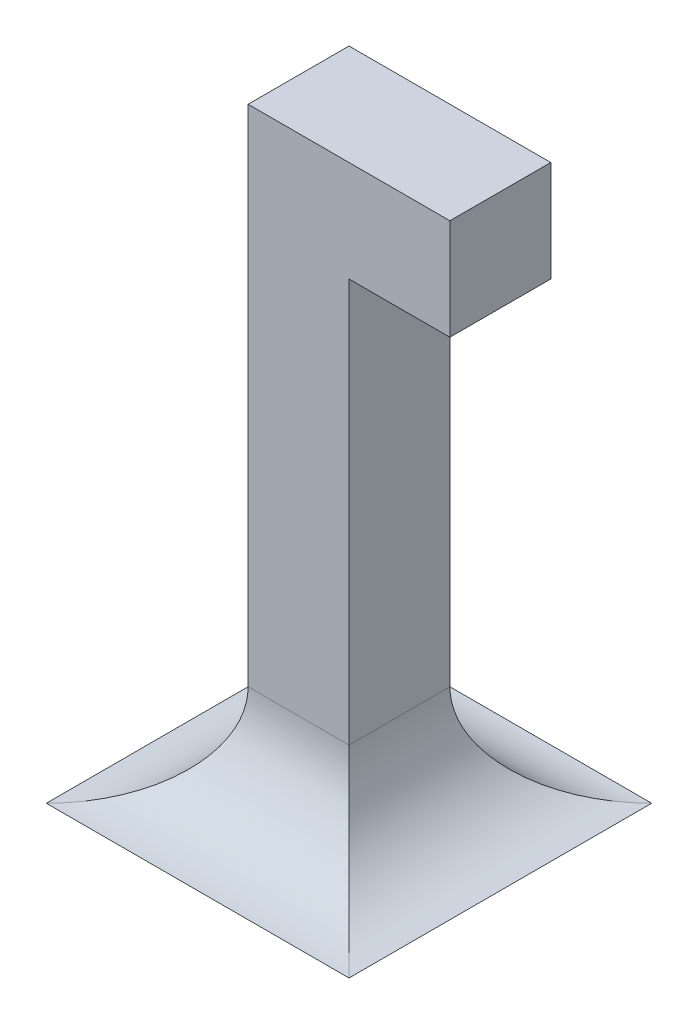
ISO-10303-21;
HEADER;
FILE_DESCRIPTION(('STEP AP214'),'2;1');
FILE_NAME('part.step','',(''),(''),'','','');
FILE_SCHEMA(('AUTOMOTIVE_DESIGN { 1 0 10303 214 1 1 1 1 }'));
ENDSEC;
DATA;
#1=APPLICATION_CONTEXT('core data for automotive mechanical design processes');
#2=APPLICATION_PROTOCOL_DEFINITION('international standard','automotive_design',2000,#1);
#3=PRODUCT_CONTEXT('',#1,'mechanical');
#4=PRODUCT('Part','Part','',(#3));
#5=PRODUCT_RELATED_PRODUCT_CATEGORY('part','',(#4));
#6=PRODUCT_DEFINITION_FORMATION('','',#4);
#7=PRODUCT_DEFINITION_CONTEXT('part definition',#1,'design');
#8=PRODUCT_DEFINITION('design','',#6,#7);
#9=PRODUCT_DEFINITION_SHAPE('','',#8);
#10=(LENGTH_UNIT() NAMED_UNIT(*) SI_UNIT(.MILLI.,.METRE.));
#11=(NAMED_UNIT(*) PLANE_ANGLE_UNIT() SI_UNIT($,.RADIAN.));
#12=(NAMED_UNIT(*) SI_UNIT($,.STERADIAN.) SOLID_ANGLE_UNIT());
#13=UNCERTAINTY_MEASURE_WITH_UNIT(LENGTH_MEASURE(1.E-05),#10,'distance_accuracy_value','');
#14=(GEOMETRIC_REPRESENTATION_CONTEXT(3) GLOBAL_UNCERTAINTY_ASSIGNED_CONTEXT((#13)) GLOBAL_UNIT_ASSIGNED_CONTEXT((#10,
#11,#12)) REPRESENTATION_CONTEXT('',''));
#15=CARTESIAN_POINT('',(0.,0.,0.));
#16=DIRECTION('',(0.,0.,1.));
#17=DIRECTION('',(1.,0.,0.));
#18=AXIS2_PLACEMENT_3D('',#15,#16,#17);
#19=CARTESIAN_POINT('',(83.9958786609766,35.,-15.));
#20=DIRECTION('',(0.,1.,0.));
#21=DIRECTION('',(0.,0.,1.));
#22=AXIS2_PLACEMENT_3D('',#19,#20,#21);
#23=PLANE('',#22);
#24=DIRECTION('',(0.,0.,-1.));
#25=VECTOR('',#24,1.);
#26=CARTESIAN_POINT('',(78.9958786609766,35.,-15.));
#27=LINE('',#26,#25);
#28=CARTESIAN_POINT('',(78.9958786609766,35.,-15.));
#29=VERTEX_POINT('',#28);
#30=CARTESIAN_POINT('',(78.9958786609766,35.,-20.));
#31=VERTEX_POINT('',#30);
#32=EDGE_CURVE('E147',#29,#31,#27,.T.);
#33=ORIENTED_EDGE('',*,*,#32,.T.);
#34=DIRECTION('',(-1.,0.,0.));
#35=VECTOR('',#34,1.);
#36=CARTESIAN_POINT('',(83.9958786609766,35.,-20.));
#37=LINE('',#36,#35);
#38=CARTESIAN_POINT('',(83.9958786609766,35.,-20.));
#39=VERTEX_POINT('',#38);
#40=EDGE_CURVE('E161',#39,#31,#37,.T.);
#41=ORIENTED_EDGE('',*,*,#40,.F.);
#42=DIRECTION('',(0.,0.,-1.));
#43=VECTOR('',#42,1.);
#44=CARTESIAN_POINT('',(83.9958786609766,35.,-15.));
#45=LINE('',#44,#43);
#46=CARTESIAN_POINT('',(83.9958786609766,35.,-15.));
#47=VERTEX_POINT('',#46);
#48=EDGE_CURVE('E155',#47,#39,#45,.T.);
#49=ORIENTED_EDGE('',*,*,#48,.F.);
#50=DIRECTION('',(-1.,0.,0.));
#51=VECTOR('',#50,1.);
#52=CARTESIAN_POINT('',(83.9958786609766,35.,-15.));
#53=LINE('',#52,#51);
#54=EDGE_CURVE('E163',#47,#29,#53,.T.);
#55=ORIENTED_EDGE('',*,*,#54,.T.);
#56=EDGE_LOOP('',(#33,#41,#49,#55));
#57=FACE_BOUND('',#56,.T.);
#58=ADVANCED_FACE('F43',(#57),#23,.F.);
#59=CARTESIAN_POINT('',(83.9958786609766,0.,0.));
#60=DIRECTION('',(1.,0.,0.));
#61=DIRECTION('',(0.,0.,-1.));
#62=AXIS2_PLACEMENT_3D('',#59,#60,#61);
#63=PLANE('',#62);
#64=DIRECTION('',(0.,-1.,0.));
#65=VECTOR('',#64,1.);
#66=CARTESIAN_POINT('',(83.9958786609766,40.,-15.));
#67=LINE('',#66,#65);
#68=CARTESIAN_POINT('',(83.9958786609766,40.,-15.));
#69=VERTEX_POINT('',#68);
#70=EDGE_CURVE('E148',#69,#47,#67,.T.);
#71=ORIENTED_EDGE('',*,*,#70,.T.);
#72=ORIENTED_EDGE('',*,*,#48,.T.);
#73=DIRECTION('',(0.,1.,0.));
#74=VECTOR('',#73,1.);
#75=CARTESIAN_POINT('',(83.9958786609766,40.,-20.));
#76=LINE('',#75,#74);
#77=CARTESIAN_POINT('',(83.9958786609766,40.,-20.));
#78=VERTEX_POINT('',#77);
#79=EDGE_CURVE('E323',#39,#78,#76,.T.);
#80=ORIENTED_EDGE('',*,*,#79,.T.);
#81=DIRECTION('',(0.,0.,1.));
#82=VECTOR('',#81,1.);
#83=CARTESIAN_POINT('',(83.9958786609766,40.,-15.));
#84=LINE('',#83,#82);
#85=EDGE_CURVE('E159',#78,#69,#84,.T.);
#86=ORIENTED_EDGE('',*,*,#85,.T.);
#87=EDGE_LOOP('',(#71,#72,#80,#86));
#88=FACE_BOUND('',#87,.T.);
#89=ADVANCED_FACE('F196',(#88),#63,.T.);
#90=CARTESIAN_POINT('',(0.,40.,0.));
#91=DIRECTION('',(0.,1.,0.));
#92=DIRECTION('',(0.,0.,1.));
#93=AXIS2_PLACEMENT_3D('',#90,#91,#92);
#94=PLANE('',#93);
#95=DIRECTION('',(1.,0.,0.));
#96=VECTOR('',#95,1.);
#97=CARTESIAN_POINT('',(73.9958786609766,40.,-15.));
#98=LINE('',#97,#96);
#99=CARTESIAN_POINT('',(73.9958786609766,40.,-15.));
#100=VERTEX_POINT('',#99);
#101=EDGE_CURVE('E169',#100,#69,#98,.T.);
#102=ORIENTED_EDGE('',*,*,#101,.T.);
#103=ORIENTED_EDGE('',*,*,#85,.F.);
#104=DIRECTION('',(-1.,0.,0.));
#105=VECTOR('',#104,1.);
#106=CARTESIAN_POINT('',(73.9958786609766,40.,-20.));
#107=LINE('',#106,#105);
#108=CARTESIAN_POINT('',(73.9958786609766,40.,-20.));
#109=VERTEX_POINT('',#108);
#110=EDGE_CURVE('E165',#78,#109,#107,.T.);
#111=ORIENTED_EDGE('',*,*,#110,.T.);
#112=DIRECTION('',(0.,0.,1.));
#113=VECTOR('',#112,1.);
#114=CARTESIAN_POINT('',(73.9958786609766,40.,-20.));
#115=LINE('',#114,#113);
#116=EDGE_CURVE('E167',#109,#100,#115,.T.);
#117=ORIENTED_EDGE('',*,*,#116,.T.);
#118=EDGE_LOOP('',(#102,#103,#111,#117));
#119=FACE_BOUND('',#118,.T.);
#120=ADVANCED_FACE('F201',(#119),#94,.T.);
#121=CARTESIAN_POINT('',(73.9958786609766,40.,-15.));
#122=DIRECTION('',(0.,0.,-1.));
#123=DIRECTION('',(-1.,0.,0.));
#124=AXIS2_PLACEMENT_3D('',#121,#122,#123);
#125=PLANE('',#124);
#126=DIRECTION('',(0.,-1.,0.));
#127=VECTOR('',#126,1.);
#128=CARTESIAN_POINT('',(73.9958786609766,40.,-15.));
#129=LINE('',#128,#127);
#130=CARTESIAN_POINT('',(73.9958786609766,15.,-15.));
#131=VERTEX_POINT('',#130);
#132=EDGE_CURVE('E173',#100,#131,#129,.T.);
#133=ORIENTED_EDGE('',*,*,#132,.T.);
#134=DIRECTION('',(1.,0.,0.));
#135=VECTOR('',#134,1.);
#136=CARTESIAN_POINT('',(73.9958786609766,15.,-15.));
#137=LINE('',#136,#135);
#138=CARTESIAN_POINT('',(78.9958786609766,15.,-15.));
#139=VERTEX_POINT('',#138);
#140=EDGE_CURVE('E66',#131,#139,#137,.T.);
#141=ORIENTED_EDGE('',*,*,#140,.T.);
#142=DIRECTION('',(0.,-1.,0.));
#143=VECTOR('',#142,1.);
#144=CARTESIAN_POINT('',(78.9958786609766,40.,-15.));
#145=LINE('',#144,#143);
#146=EDGE_CURVE('E171',#29,#139,#145,.T.);
#147=ORIENTED_EDGE('',*,*,#146,.F.);
#148=ORIENTED_EDGE('',*,*,#54,.F.);
#149=ORIENTED_EDGE('',*,*,#70,.F.);
#150=ORIENTED_EDGE('',*,*,#101,.F.);
#151=EDGE_LOOP('',(#133,#141,#147,#148,#149,#150));
#152=FACE_BOUND('',#151,.T.);
#153=ADVANCED_FACE('F208',(#152),#125,.F.);
#154=CARTESIAN_POINT('',(78.9958786609766,40.,-20.));
#155=DIRECTION('',(-1.,0.,0.));
#156=DIRECTION('',(0.,0.,1.));
#157=AXIS2_PLACEMENT_3D('',#154,#155,#156);
#158=PLANE('',#157);
#159=ORIENTED_EDGE('',*,*,#146,.T.);
#160=DIRECTION('',(0.,0.,-1.));
#161=VECTOR('',#160,1.);
#162=CARTESIAN_POINT('',(78.9958786609766,15.,-20.));
#163=LINE('',#162,#161);
#164=CARTESIAN_POINT('',(78.9958786609766,15.,-20.));
#165=VERTEX_POINT('',#164);
#166=EDGE_CURVE('E11',#139,#165,#163,.T.);
#167=ORIENTED_EDGE('',*,*,#166,.T.);
#168=DIRECTION('',(0.,-1.,0.));
#169=VECTOR('',#168,1.);
#170=CARTESIAN_POINT('',(78.9958786609766,40.,-20.));
#171=LINE('',#170,#169);
#172=EDGE_CURVE('E121',#31,#165,#171,.T.);
#173=ORIENTED_EDGE('',*,*,#172,.F.);
#174=ORIENTED_EDGE('',*,*,#32,.F.);
#175=EDGE_LOOP('',(#159,#167,#173,#174));
#176=FACE_BOUND('',#175,.T.);
#177=ADVANCED_FACE('F184',(#176),#158,.F.);
#178=CARTESIAN_POINT('',(73.9958786609766,40.,-20.));
#179=DIRECTION('',(1.,0.,0.));
#180=DIRECTION('',(0.,0.,-1.));
#181=AXIS2_PLACEMENT_3D('',#178,#179,#180);
#182=PLANE('',#181);
#183=DIRECTION('',(0.,-1.,0.));
#184=VECTOR('',#183,1.);
#185=CARTESIAN_POINT('',(73.9958786609766,40.,-20.));
#186=LINE('',#185,#184);
#187=CARTESIAN_POINT('',(73.9958786609766,15.,-20.));
#188=VERTEX_POINT('',#187);
#189=EDGE_CURVE('E175',#109,#188,#186,.T.);
#190=ORIENTED_EDGE('',*,*,#189,.T.);
#191=DIRECTION('',(0.,0.,1.));
#192=VECTOR('',#191,1.);
#193=CARTESIAN_POINT('',(73.9958786609766,15.,-20.));
#194=LINE('',#193,#192);
#195=EDGE_CURVE('E52',#188,#131,#194,.T.);
#196=ORIENTED_EDGE('',*,*,#195,.T.);
#197=ORIENTED_EDGE('',*,*,#132,.F.);
#198=ORIENTED_EDGE('',*,*,#116,.F.);
#199=EDGE_LOOP('',(#190,#196,#197,#198));
#200=FACE_BOUND('',#199,.T.);
#201=ADVANCED_FACE('F212',(#200),#182,.F.);
#202=CARTESIAN_POINT('',(73.9958786609766,40.,-20.));
#203=DIRECTION('',(0.,0.,1.));
#204=DIRECTION('',(1.,0.,0.));
#205=AXIS2_PLACEMENT_3D('',#202,#203,#204);
#206=PLANE('',#205);
#207=ORIENTED_EDGE('',*,*,#172,.T.);
#208=DIRECTION('',(-1.,0.,0.));
#209=VECTOR('',#208,1.);
#210=CARTESIAN_POINT('',(73.9958786609766,15.,-20.));
#211=LINE('',#210,#209);
#212=EDGE_CURVE('E120',#165,#188,#211,.T.);
#213=ORIENTED_EDGE('',*,*,#212,.T.);
#214=ORIENTED_EDGE('',*,*,#189,.F.);
#215=ORIENTED_EDGE('',*,*,#110,.F.);
#216=ORIENTED_EDGE('',*,*,#79,.F.);
#217=ORIENTED_EDGE('',*,*,#40,.T.);
#218=EDGE_LOOP('',(#207,#213,#214,#215,#216,#217));
#219=FACE_BOUND('',#218,.T.);
#220=ADVANCED_FACE('F180',(#219),#206,.F.);
#221=CARTESIAN_POINT('',(73.9958786609766,15.,-25.));
#222=DIRECTION('',(-1.,0.,0.));
#223=DIRECTION('',(0.,0.,1.));
#224=AXIS2_PLACEMENT_3D('',#221,#222,#223);
#225=CYLINDRICAL_SURFACE('',#224,5.);
#226=CARTESIAN_POINT('',(83.9958786609766,15.,-25.));
#227=DIRECTION('',(-0.707106781186547,0.,-0.707106781186547));
#228=DIRECTION('',(0.707106781186547,0.,-0.707106781186547));
#229=AXIS2_PLACEMENT_3D('',#226,#227,#228);
#230=ELLIPSE('',#229,7.07106781186547,5.);
#231=CARTESIAN_POINT('',(83.9958786609766,10.,-25.));
#232=VERTEX_POINT('',#231);
#233=EDGE_CURVE('E125',#165,#232,#230,.F.);
#234=ORIENTED_EDGE('',*,*,#233,.T.);
#235=DIRECTION('',(-1.,0.,0.));
#236=VECTOR('',#235,1.);
#237=CARTESIAN_POINT('',(17.5,10.,-25.));
#238=LINE('',#237,#236);
#239=CARTESIAN_POINT('',(68.9958786609766,10.,-25.));
#240=VERTEX_POINT('',#239);
#241=EDGE_CURVE('E110',#232,#240,#238,.T.);
#242=ORIENTED_EDGE('',*,*,#241,.T.);
#243=CARTESIAN_POINT('',(68.9958786609766,15.,-25.));
#244=DIRECTION('',(-0.707106781186547,0.,0.707106781186547));
#245=DIRECTION('',(0.707106781186547,0.,0.707106781186547));
#246=AXIS2_PLACEMENT_3D('',#243,#244,#245);
#247=ELLIPSE('',#246,7.07106781186547,5.);
#248=EDGE_CURVE('E131',#240,#188,#247,.T.);
#249=ORIENTED_EDGE('',*,*,#248,.T.);
#250=ORIENTED_EDGE('',*,*,#212,.F.);
#251=EDGE_LOOP('',(#234,#242,#249,#250));
#252=FACE_BOUND('',#251,.T.);
#253=ADVANCED_FACE('F126',(#252),#225,.F.);
#254=CARTESIAN_POINT('',(68.9958786609766,15.,-20.));
#255=DIRECTION('',(0.,0.,1.));
#256=DIRECTION('',(1.,0.,0.));
#257=AXIS2_PLACEMENT_3D('',#254,#255,#256);
#258=CYLINDRICAL_SURFACE('',#257,5.);
#259=CARTESIAN_POINT('',(68.9958786609766,15.,-9.99999999999998));
#260=DIRECTION('',(0.707106781186547,0.,0.707106781186547));
#261=DIRECTION('',(-0.707106781186547,0.,0.707106781186547));
#262=AXIS2_PLACEMENT_3D('',#259,#260,#261);
#263=ELLIPSE('',#262,7.07106781186547,5.);
#264=CARTESIAN_POINT('',(68.9958786609766,10.,-9.99999999999998));
#265=VERTEX_POINT('',#264);
#266=EDGE_CURVE('E130',#265,#131,#263,.T.);
#267=ORIENTED_EDGE('',*,*,#266,.T.);
#268=ORIENTED_EDGE('',*,*,#195,.F.);
#269=ORIENTED_EDGE('',*,*,#248,.F.);
#270=DIRECTION('',(0.,0.,1.));
#271=VECTOR('',#270,1.);
#272=CARTESIAN_POINT('',(68.9958786609766,10.,0.));
#273=LINE('',#272,#271);
#274=EDGE_CURVE('E117',#265,#240,#273,.F.);
#275=ORIENTED_EDGE('',*,*,#274,.F.);
#276=EDGE_LOOP('',(#267,#268,#269,#275));
#277=FACE_BOUND('',#276,.T.);
#278=ADVANCED_FACE('F187',(#277),#258,.F.);
#279=CARTESIAN_POINT('',(83.9958786609766,15.,-20.));
#280=DIRECTION('',(0.,0.,-1.));
#281=DIRECTION('',(-1.,0.,0.));
#282=AXIS2_PLACEMENT_3D('',#279,#280,#281);
#283=CYLINDRICAL_SURFACE('',#282,5.);
#284=CARTESIAN_POINT('',(83.9958786609766,15.,-9.99999999999998));
#285=DIRECTION('',(0.707106781186547,0.,-0.707106781186547));
#286=DIRECTION('',(-0.707106781186547,0.,-0.707106781186547));
#287=AXIS2_PLACEMENT_3D('',#284,#285,#286);
#288=ELLIPSE('',#287,7.07106781186547,5.);
#289=CARTESIAN_POINT('',(83.9958786609766,10.,-9.99999999999998));
#290=VERTEX_POINT('',#289);
#291=EDGE_CURVE('E47',#139,#290,#288,.F.);
#292=ORIENTED_EDGE('',*,*,#291,.T.);
#293=DIRECTION('',(0.,0.,-1.));
#294=VECTOR('',#293,1.);
#295=CARTESIAN_POINT('',(83.9958786609766,10.,0.));
#296=LINE('',#295,#294);
#297=EDGE_CURVE('E114',#232,#290,#296,.F.);
#298=ORIENTED_EDGE('',*,*,#297,.F.);
#299=ORIENTED_EDGE('',*,*,#233,.F.);
#300=ORIENTED_EDGE('',*,*,#166,.F.);
#301=EDGE_LOOP('',(#292,#298,#299,#300));
#302=FACE_BOUND('',#301,.T.);
#303=ADVANCED_FACE('F134',(#302),#283,.F.);
#304=CARTESIAN_POINT('',(73.9958786609766,15.,-9.99999999999998));
#305=DIRECTION('',(1.,0.,0.));
#306=DIRECTION('',(0.,0.,-1.));
#307=AXIS2_PLACEMENT_3D('',#304,#305,#306);
#308=CYLINDRICAL_SURFACE('',#307,5.);
#309=ORIENTED_EDGE('',*,*,#266,.F.);
#310=DIRECTION('',(1.,0.,0.));
#311=VECTOR('',#310,1.);
#312=CARTESIAN_POINT('',(0.,10.,-9.99999999999998));
#313=LINE('',#312,#311);
#314=EDGE_CURVE('E136',#290,#265,#313,.F.);
#315=ORIENTED_EDGE('',*,*,#314,.F.);
#316=ORIENTED_EDGE('',*,*,#291,.F.);
#317=ORIENTED_EDGE('',*,*,#140,.F.);
#318=EDGE_LOOP('',(#309,#315,#316,#317));
#319=FACE_BOUND('',#318,.T.);
#320=ADVANCED_FACE('F45',(#319),#308,.F.);
#321=CARTESIAN_POINT('',(-11.0041213390234,10.,75.));
#322=DIRECTION('',(0.,1.,0.));
#323=DIRECTION('',(0.,0.,1.));
#324=AXIS2_PLACEMENT_3D('',#321,#322,#323);
#325=PLANE('',#324);
#326=ORIENTED_EDGE('',*,*,#297,.T.);
#327=ORIENTED_EDGE('',*,*,#314,.T.);
#328=ORIENTED_EDGE('',*,*,#274,.T.);
#329=ORIENTED_EDGE('',*,*,#241,.F.);
#330=EDGE_LOOP('',(#326,#327,#328,#329));
#331=FACE_BOUND('',#330,.T.);
#332=ADVANCED_FACE('F112',(#331),#325,.F.);
#333=CLOSED_SHELL('',(#58,#89,#120,#153,#177,#201,#220,#253,#278,#303,#320,#332));
#334=MANIFOLD_SOLID_BREP('B2',#333);
#335=ADVANCED_BREP_SHAPE_REPRESENTATION('',(#18,#334),#14);
#336=SHAPE_DEFINITION_REPRESENTATION(#9,#335);
ENDSEC;
END-ISO-10303-21;
